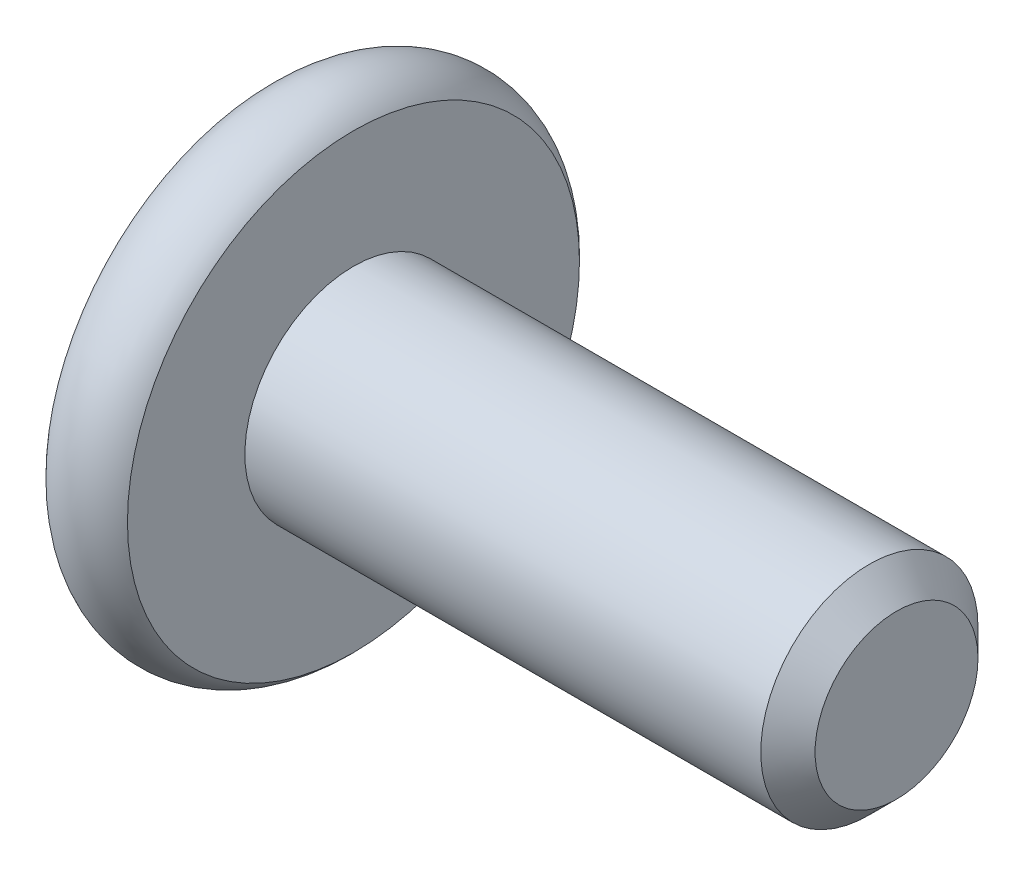
ISO-10303-21;
HEADER;
FILE_DESCRIPTION(('STEP AP214'),'2;1');
FILE_NAME('part.step','',(''),(''),'','','');
FILE_SCHEMA(('AUTOMOTIVE_DESIGN { 1 0 10303 214 1 1 1 1 }'));
ENDSEC;
DATA;
#1=APPLICATION_CONTEXT('core data for automotive mechanical design processes');
#2=APPLICATION_PROTOCOL_DEFINITION('international standard','automotive_design',2000,#1);
#3=PRODUCT_CONTEXT('',#1,'mechanical');
#4=PRODUCT('Part','Part','',(#3));
#5=PRODUCT_RELATED_PRODUCT_CATEGORY('part','',(#4));
#6=PRODUCT_DEFINITION_FORMATION('','',#4);
#7=PRODUCT_DEFINITION_CONTEXT('part definition',#1,'design');
#8=PRODUCT_DEFINITION('design','',#6,#7);
#9=PRODUCT_DEFINITION_SHAPE('','',#8);
#10=(LENGTH_UNIT() NAMED_UNIT(*) SI_UNIT(.MILLI.,.METRE.));
#11=(NAMED_UNIT(*) PLANE_ANGLE_UNIT() SI_UNIT($,.RADIAN.));
#12=(NAMED_UNIT(*) SI_UNIT($,.STERADIAN.) SOLID_ANGLE_UNIT());
#13=UNCERTAINTY_MEASURE_WITH_UNIT(LENGTH_MEASURE(1.E-05),#10,'distance_accuracy_value','');
#14=(GEOMETRIC_REPRESENTATION_CONTEXT(3) GLOBAL_UNCERTAINTY_ASSIGNED_CONTEXT((#13)) GLOBAL_UNIT_ASSIGNED_CONTEXT((#10,
#11,#12)) REPRESENTATION_CONTEXT('',''));
#15=CARTESIAN_POINT('',(0.,0.,0.));
#16=DIRECTION('',(0.,0.,1.));
#17=DIRECTION('',(1.,0.,0.));
#18=AXIS2_PLACEMENT_3D('',#15,#16,#17);
#19=CARTESIAN_POINT('',(-10.,0.,0.));
#20=DIRECTION('',(1.,0.,0.));
#21=DIRECTION('',(0.,0.,-1.));
#22=AXIS2_PLACEMENT_3D('',#19,#20,#21);
#23=CYLINDRICAL_SURFACE('',#22,2.);
#24=CARTESIAN_POINT('',(-0.500000000000004,0.,0.));
#25=DIRECTION('',(1.,0.,0.));
#26=DIRECTION('',(0.,0.,-1.));
#27=AXIS2_PLACEMENT_3D('',#24,#25,#26);
#28=CIRCLE('',#27,2.);
#29=CARTESIAN_POINT('',(-0.500000000000004,0.,-2.));
#30=VERTEX_POINT('',#29);
#31=EDGE_CURVE('E49',#30,#30,#28,.F.);
#32=ORIENTED_EDGE('',*,*,#31,.T.);
#33=EDGE_LOOP('',(#32));
#34=FACE_BOUND('',#33,.T.);
#35=CARTESIAN_POINT('',(-10.,0.,0.));
#36=DIRECTION('',(1.,0.,0.));
#37=DIRECTION('',(0.,1.,0.));
#38=AXIS2_PLACEMENT_3D('',#35,#36,#37);
#39=CIRCLE('',#38,2.);
#40=CARTESIAN_POINT('',(-10.,1.99999999999999,0.));
#41=VERTEX_POINT('',#40);
#42=EDGE_CURVE('E134',#41,#41,#39,.F.);
#43=ORIENTED_EDGE('',*,*,#42,.F.);
#44=EDGE_LOOP('',(#43));
#45=FACE_BOUND('',#44,.T.);
#46=ADVANCED_FACE('F35',(#34,#45),#23,.T.);
#47=CARTESIAN_POINT('',(0.,0.,0.));
#48=DIRECTION('',(1.,0.,0.));
#49=DIRECTION('',(0.,0.,-1.));
#50=AXIS2_PLACEMENT_3D('',#47,#48,#49);
#51=PLANE('',#50);
#52=CARTESIAN_POINT('',(0.,0.,0.));
#53=DIRECTION('',(1.,0.,0.));
#54=DIRECTION('',(0.,0.,-1.));
#55=AXIS2_PLACEMENT_3D('',#52,#53,#54);
#56=CIRCLE('',#55,1.5);
#57=CARTESIAN_POINT('',(0.,0.,-1.5));
#58=VERTEX_POINT('',#57);
#59=EDGE_CURVE('E138',#58,#58,#56,.T.);
#60=ORIENTED_EDGE('',*,*,#59,.T.);
#61=EDGE_LOOP('',(#60));
#62=FACE_BOUND('',#61,.T.);
#63=ADVANCED_FACE('F152',(#62),#51,.T.);
#64=CARTESIAN_POINT('',(0.,0.,0.));
#65=DIRECTION('',(-1.,0.,0.));
#66=DIRECTION('',(0.,0.,1.));
#67=AXIS2_PLACEMENT_3D('',#64,#65,#66);
#68=CONICAL_SURFACE('',#67,1.5,0.785398163397447);
#69=ORIENTED_EDGE('',*,*,#31,.F.);
#70=EDGE_LOOP('',(#69));
#71=FACE_BOUND('',#70,.T.);
#72=ORIENTED_EDGE('',*,*,#59,.F.);
#73=EDGE_LOOP('',(#72));
#74=FACE_BOUND('',#73,.T.);
#75=ADVANCED_FACE('F37',(#71,#74),#68,.T.);
#76=CARTESIAN_POINT('',(-11.5,0.,0.));
#77=DIRECTION('',(-1.,0.,0.));
#78=DIRECTION('',(0.,-1.,0.));
#79=AXIS2_PLACEMENT_3D('',#76,#77,#78);
#80=PLANE('',#79);
#81=CARTESIAN_POINT('',(-11.5,0.,0.));
#82=DIRECTION('',(-1.,0.,0.));
#83=DIRECTION('',(0.,-1.,0.));
#84=AXIS2_PLACEMENT_3D('',#81,#82,#83);
#85=CIRCLE('',#84,1.78205080756887);
#86=CARTESIAN_POINT('',(-11.5,-1.78205080756883,0.));
#87=VERTEX_POINT('',#86);
#88=EDGE_CURVE('E376',#87,#87,#85,.T.);
#89=ORIENTED_EDGE('',*,*,#88,.F.);
#90=EDGE_LOOP('',(#89));
#91=FACE_BOUND('',#90,.T.);
#92=CARTESIAN_POINT('',(-11.5,0.,0.));
#93=DIRECTION('',(1.,0.,0.));
#94=DIRECTION('',(0.,1.,0.));
#95=AXIS2_PLACEMENT_3D('',#92,#93,#94);
#96=CIRCLE('',#95,4.16143782776615);
#97=CARTESIAN_POINT('',(-11.5,4.16143782776615,0.));
#98=VERTEX_POINT('',#97);
#99=EDGE_CURVE('E130',#98,#98,#96,.T.);
#100=ORIENTED_EDGE('',*,*,#99,.F.);
#101=EDGE_LOOP('',(#100));
#102=FACE_BOUND('',#101,.T.);
#103=ADVANCED_FACE('F151',(#91,#102),#80,.T.);
#104=CARTESIAN_POINT('',(-10.75,0.,0.));
#105=DIRECTION('',(1.,0.,0.));
#106=DIRECTION('',(0.,1.,0.));
#107=AXIS2_PLACEMENT_3D('',#104,#105,#106);
#108=TOROIDAL_SURFACE('',#107,3.5,1.);
#109=ORIENTED_EDGE('',*,*,#99,.T.);
#110=EDGE_LOOP('',(#109));
#111=FACE_BOUND('',#110,.T.);
#112=CARTESIAN_POINT('',(-10.,0.,0.));
#113=DIRECTION('',(1.,0.,0.));
#114=DIRECTION('',(0.,1.,0.));
#115=AXIS2_PLACEMENT_3D('',#112,#113,#114);
#116=CIRCLE('',#115,4.16143782776615);
#117=CARTESIAN_POINT('',(-10.,4.16143782776615,0.));
#118=VERTEX_POINT('',#117);
#119=EDGE_CURVE('E126',#118,#118,#116,.T.);
#120=ORIENTED_EDGE('',*,*,#119,.F.);
#121=EDGE_LOOP('',(#120));
#122=FACE_BOUND('',#121,.T.);
#123=ADVANCED_FACE('F163',(#111,#122),#108,.T.);
#124=CARTESIAN_POINT('',(-10.,4.16143782776615,0.));
#125=DIRECTION('',(1.,0.,0.));
#126=DIRECTION('',(0.,1.,0.));
#127=AXIS2_PLACEMENT_3D('',#124,#125,#126);
#128=PLANE('',#127);
#129=ORIENTED_EDGE('',*,*,#42,.T.);
#130=EDGE_LOOP('',(#129));
#131=FACE_BOUND('',#130,.T.);
#132=ORIENTED_EDGE('',*,*,#119,.T.);
#133=EDGE_LOOP('',(#132));
#134=FACE_BOUND('',#133,.T.);
#135=ADVANCED_FACE('F167',(#131,#134),#128,.T.);
#136=CARTESIAN_POINT('',(-11.5,0.,0.));
#137=DIRECTION('',(-1.,0.,0.));
#138=DIRECTION('',(0.,-1.,0.));
#139=AXIS2_PLACEMENT_3D('',#136,#137,#138);
#140=CONICAL_SURFACE('',#139,1.78205080756887,0.78539816339745);
#141=ORIENTED_EDGE('',*,*,#88,.T.);
#142=EDGE_LOOP('',(#141));
#143=FACE_BOUND('',#142,.T.);
#144=CARTESIAN_POINT('',(-12.015428085613,-1.74023253176579,1.5));
#145=CARTESIAN_POINT('',(-11.9833811073445,-1.69791724929732,1.5));
#146=CARTESIAN_POINT('',(-11.9516444672841,-1.65536760966793,1.5));
#147=CARTESIAN_POINT('',(-11.8889203936153,-1.56970398156686,1.5));
#148=CARTESIAN_POINT('',(-11.85793314822,-1.5265898554285,1.5));
#149=CARTESIAN_POINT('',(-11.765846164345,-1.39562626326564,1.5));
#150=CARTESIAN_POINT('',(-11.7061145123021,-1.30679868010577,1.5));
#151=CARTESIAN_POINT('',(-11.5887342891012,-1.12044622640216,1.5));
#152=CARTESIAN_POINT('',(-11.5314082774822,-1.02271587306674,1.5));
#153=CARTESIAN_POINT('',(-11.426463214976,-0.822357214965268,1.5));
#154=CARTESIAN_POINT('',(-11.3788114236896,-0.719746931701931,1.5));
#155=CARTESIAN_POINT('',(-11.320509988315,-0.565852387095104,1.5));
#156=CARTESIAN_POINT('',(-11.3037990535409,-0.516874191424692,1.5));
#157=CARTESIAN_POINT('',(-11.2743077515089,-0.417723988457531,1.5));
#158=CARTESIAN_POINT('',(-11.2615276514219,-0.367551900263897,1.5));
#159=CARTESIAN_POINT('',(-11.2407784202458,-0.267158299056148,1.5));
#160=CARTESIAN_POINT('',(-11.2327260618259,-0.216954261864884,1.5));
#161=CARTESIAN_POINT('',(-11.221591636834,-0.115994915871349,1.5));
#162=CARTESIAN_POINT('',(-11.2185086886377,-0.0652397064615661,1.5));
#163=CARTESIAN_POINT('',(-11.2175473897404,0.0344222234875302,1.5));
#164=CARTESIAN_POINT('',(-11.2194789216952,0.0833271701100644,1.5));
#165=CARTESIAN_POINT('',(-11.2280175729677,0.180724293127197,1.5));
#166=CARTESIAN_POINT('',(-11.234625142048,0.229216429361705,1.5));
#167=CARTESIAN_POINT('',(-11.2522650626447,0.326258027696984,1.5));
#168=CARTESIAN_POINT('',(-11.263373168201,0.374793507450005,1.5));
#169=CARTESIAN_POINT('',(-11.2894198669595,0.470802295834159,1.5));
#170=CARTESIAN_POINT('',(-11.3043581560035,0.518275688481262,1.5));
#171=CARTESIAN_POINT('',(-11.356839545716,0.667150562065111,1.5));
#172=CARTESIAN_POINT('',(-11.4003351165442,0.76644836242683,1.5));
#173=CARTESIAN_POINT('',(-11.4970587814836,0.960384405673816,1.5));
#174=CARTESIAN_POINT('',(-11.5503217226675,1.05500437383619,1.5));
#175=CARTESIAN_POINT('',(-11.6602258010453,1.2358452032153,1.5));
#176=CARTESIAN_POINT('',(-11.7165682531046,1.32224986946548,1.5));
#177=CARTESIAN_POINT('',(-11.803675572597,1.44954953726471,1.5));
#178=CARTESIAN_POINT('',(-11.8330199906839,1.49143368482421,1.5));
#179=CARTESIAN_POINT('',(-11.892486918293,1.57462914783242,1.5));
#180=CARTESIAN_POINT('',(-11.9226092115007,1.61594061772577,1.5));
#181=CARTESIAN_POINT('',(-11.9530541181365,1.65701358742551,1.5));
#182=B_SPLINE_CURVE_WITH_KNOTS('',3,(#144,#145,#146,#147,#148,#149,#150,#151,#152,#153,#154,
#155,#156,#157,#158,#159,#160,#161,#162,#163,#164,#165,#166,#167,#168,#169,#170,#171,#172,#173,
#174,#175,#176,#177,#178,#179,#180,#181),.UNSPECIFIED.,.F.,.F.,(4,2,2,2,2,2,2,2,2,2,2,2,2,2,2,2,
2,2,4),(0.,0.159238974218354,0.318517535014542,0.639504781932389,0.9791378937992,
1.31760168934357,1.47272233841624,1.62785352839776,1.78016486537347,1.93244917778279,
2.07904486260298,2.22565464958333,2.37484213303399,2.5240177730404,2.84828365283776,
3.1737297566675,3.48303030530537,3.63644667013909,3.78982082222913),.UNSPECIFIED.);
#183=CARTESIAN_POINT('',(-11.45,-0.866025403784405,1.5));
#184=VERTEX_POINT('',#183);
#185=CARTESIAN_POINT('',(-11.45,0.866025403784473,1.5));
#186=VERTEX_POINT('',#185);
#187=EDGE_CURVE('E104',#184,#186,#182,.T.);
#188=ORIENTED_EDGE('',*,*,#187,.F.);
#189=CARTESIAN_POINT('',(-11.4501154816001,-1.73216627762268,-0.0002000000000008));
#190=CARTESIAN_POINT('',(-11.4203654760673,-1.70239359975912,0.0513677907370747));
#191=CARTESIAN_POINT('',(-11.3923624839103,-1.67212305186352,0.1037979176652));
#192=CARTESIAN_POINT('',(-11.3410892304402,-1.61039789003616,0.210709034055596));
#193=CARTESIAN_POINT('',(-11.3178475050444,-1.57893740312611,0.26520019581466));
#194=CARTESIAN_POINT('',(-11.2780337289922,-1.51549879897984,0.375079081357248));
#195=CARTESIAN_POINT('',(-11.2613615856709,-1.48353684526807,0.430438809095199));
#196=CARTESIAN_POINT('',(-11.2356744568181,-1.41890915196208,0.54237725747715));
#197=CARTESIAN_POINT('',(-11.2266402904789,-1.38624538781115,0.598952556553008));
#198=CARTESIAN_POINT('',(-11.2184890812269,-1.32995210095296,0.696455389516441));
#199=CARTESIAN_POINT('',(-11.2172822529892,-1.30639533311121,0.737256908280466));
#200=CARTESIAN_POINT('',(-11.2193140571623,-1.2593233529019,0.818787969615858));
#201=CARTESIAN_POINT('',(-11.2225536707483,-1.2358081508531,0.85951749431463));
#202=CARTESIAN_POINT('',(-11.233291985982,-1.18900414978423,0.940584402163416));
#203=CARTESIAN_POINT('',(-11.2407946530187,-1.16571558211716,0.980921384598288));
#204=CARTESIAN_POINT('',(-11.2596516119283,-1.11952932016332,1.06091833691403));
#205=CARTESIAN_POINT('',(-11.2710075570186,-1.09663179808783,1.10057800851621));
#206=CARTESIAN_POINT('',(-11.3047216475927,-1.03798159809695,1.20216313477448));
#207=CARTESIAN_POINT('',(-11.3296218490934,-1.00259267147462,1.26345855370969));
#208=CARTESIAN_POINT('',(-11.3716566532716,-0.950557780604341,1.35358562846331));
#209=CARTESIAN_POINT('',(-11.3864251535591,-0.933410759677114,1.38328513990772));
#210=CARTESIAN_POINT('',(-11.4173105659402,-0.899432101996373,1.44213790138375));
#211=CARTESIAN_POINT('',(-11.4334268341217,-0.882600319285676,1.47129140422064));
#212=CARTESIAN_POINT('',(-11.4501154816001,-0.865909933730567,1.5002));
#213=B_SPLINE_CURVE_WITH_KNOTS('',3,(#189,#190,#191,#192,#193,#194,#195,#196,#197,#198,#199,
#200,#201,#202,#203,#204,#205,#206,#207,#208,#209,#210,#211,#212),.UNSPECIFIED.,.F.,.F.,(4,2,2,
2,2,2,2,2,2,2,2,4),(0.,0.199829143693304,0.400822987382389,0.598623720538181,0.795926240188889,
0.937113067959881,1.07833105577193,1.21968061668222,1.36109089931054,1.58570969637565,
1.69770705470963,1.80965120737193),.UNSPECIFIED.);
#214=CARTESIAN_POINT('',(-11.45,-1.73205080756884,0.));
#215=VERTEX_POINT('',#214);
#216=EDGE_CURVE('E209',#215,#184,#213,.T.);
#217=ORIENTED_EDGE('',*,*,#216,.F.);
#218=CARTESIAN_POINT('',(-11.4501154816001,-0.865909933730566,-1.5002));
#219=CARTESIAN_POINT('',(-11.4203654760673,-0.895682611594131,-1.44863220926292));
#220=CARTESIAN_POINT('',(-11.3923624839103,-0.92595315948973,-1.3962020823348));
#221=CARTESIAN_POINT('',(-11.3410892304402,-0.987678321317089,-1.2892909659444));
#222=CARTESIAN_POINT('',(-11.3178475050444,-1.01913880822714,-1.23479980418534));
#223=CARTESIAN_POINT('',(-11.2780337289922,-1.08257741237341,-1.12492091864275));
#224=CARTESIAN_POINT('',(-11.2613615856709,-1.11453936608518,-1.0695611909048));
#225=CARTESIAN_POINT('',(-11.2356744568181,-1.17916705939117,-0.95762274252285));
#226=CARTESIAN_POINT('',(-11.2266402904789,-1.2118308235421,-0.901047443446992));
#227=CARTESIAN_POINT('',(-11.2184890812269,-1.26812411040029,-0.80354461048356));
#228=CARTESIAN_POINT('',(-11.2172822529892,-1.29168087824204,-0.762743091719535));
#229=CARTESIAN_POINT('',(-11.2193140571623,-1.33875285845135,-0.681212030384143));
#230=CARTESIAN_POINT('',(-11.2225536707483,-1.36226806050015,-0.640482505685371));
#231=CARTESIAN_POINT('',(-11.233291985982,-1.40907206156902,-0.559415597836585));
#232=CARTESIAN_POINT('',(-11.2407946530187,-1.43236062923609,-0.519078615401713));
#233=CARTESIAN_POINT('',(-11.2596516119283,-1.47854689118993,-0.43908166308597));
#234=CARTESIAN_POINT('',(-11.2710075570186,-1.50144441326542,-0.399421991483793));
#235=CARTESIAN_POINT('',(-11.3047216475927,-1.5600946132563,-0.297836865225516));
#236=CARTESIAN_POINT('',(-11.3296218490934,-1.59548353987863,-0.236541446290312));
#237=CARTESIAN_POINT('',(-11.3716566532716,-1.64751843074891,-0.146414371536688));
#238=CARTESIAN_POINT('',(-11.3864251535591,-1.66466545167613,-0.116714860092283));
#239=CARTESIAN_POINT('',(-11.4173105659402,-1.69864410935687,-0.0578620986162504));
#240=CARTESIAN_POINT('',(-11.4334268341217,-1.71547589206757,-0.0287085957793641));
#241=CARTESIAN_POINT('',(-11.4501154816001,-1.73216627762268,0.000199999999998858));
#242=B_SPLINE_CURVE_WITH_KNOTS('',3,(#218,#219,#220,#221,#222,#223,#224,#225,#226,#227,#228,
#229,#230,#231,#232,#233,#234,#235,#236,#237,#238,#239,#240,#241),.UNSPECIFIED.,.F.,.F.,(4,2,2,
2,2,2,2,2,2,2,2,4),(0.,0.199829143693305,0.400822987382389,0.59862372053818,0.795926240188888,
0.937113067959881,1.07833105577193,1.21968061668222,1.36109089931054,1.58570969637565,
1.69770705470963,1.80965120737194),.UNSPECIFIED.);
#243=CARTESIAN_POINT('',(-11.45,-0.866025403784404,-1.5));
#244=VERTEX_POINT('',#243);
#245=EDGE_CURVE('E204',#244,#215,#242,.T.);
#246=ORIENTED_EDGE('',*,*,#245,.F.);
#247=CARTESIAN_POINT('',(-12.0154280857208,-1.74023253190811,-1.5));
#248=CARTESIAN_POINT('',(-11.9833811074482,-1.69791724943564,-1.5));
#249=CARTESIAN_POINT('',(-11.9516444673836,-1.65536760980222,-1.5));
#250=CARTESIAN_POINT('',(-11.8889203937065,-1.56970398169306,-1.5));
#251=CARTESIAN_POINT('',(-11.8579331483071,-1.52658985555063,-1.5));
#252=CARTESIAN_POINT('',(-11.7658461644196,-1.39562626337533,-1.5));
#253=CARTESIAN_POINT('',(-11.7061145123685,-1.306798680207,-1.5));
#254=CARTESIAN_POINT('',(-11.5887342891506,-1.12044622648493,-1.5));
#255=CARTESIAN_POINT('',(-11.5314082775229,-1.02271587313946,-1.5));
#256=CARTESIAN_POINT('',(-11.4264632150005,-0.822357215017057,-1.5));
#257=CARTESIAN_POINT('',(-11.3788114237067,-0.71974693174283,-1.5));
#258=CARTESIAN_POINT('',(-11.3205099883267,-0.565852387127821,-1.5));
#259=CARTESIAN_POINT('',(-11.3037990535528,-0.516874191460856,-1.5));
#260=CARTESIAN_POINT('',(-11.2743077515206,-0.417723988500704,-1.5));
#261=CARTESIAN_POINT('',(-11.2615276514332,-0.367551900310633,-1.5));
#262=CARTESIAN_POINT('',(-11.2407784202553,-0.267158299109893,-1.5));
#263=CARTESIAN_POINT('',(-11.2327260618342,-0.216954261922074,-1.5));
#264=CARTESIAN_POINT('',(-11.2215916368391,-0.115994915935319,-1.5));
#265=CARTESIAN_POINT('',(-11.2185086886407,-0.0652397065288699,-1.5));
#266=CARTESIAN_POINT('',(-11.2175473897388,0.0344222234141573,-1.5));
#267=CARTESIAN_POINT('',(-11.219478921691,0.0833271700339477,-1.5));
#268=CARTESIAN_POINT('',(-11.228017572958,0.180724293045873,-1.5));
#269=CARTESIAN_POINT('',(-11.2346251420354,0.229216429277916,-1.5));
#270=CARTESIAN_POINT('',(-11.2522650626259,0.326258027608331,-1.5));
#271=CARTESIAN_POINT('',(-11.2633731681789,0.374793507358958,-1.5));
#272=CARTESIAN_POINT('',(-11.2894198669309,0.470802295738561,-1.5));
#273=CARTESIAN_POINT('',(-11.3043581559716,0.518275688383506,-1.5));
#274=CARTESIAN_POINT('',(-11.3568395456685,0.667150561946159,-1.5));
#275=CARTESIAN_POINT('',(-11.4003351164823,0.766448362289901,-1.5));
#276=CARTESIAN_POINT('',(-11.4970587813916,0.960384405502316,-1.5));
#277=CARTESIAN_POINT('',(-11.5503217225595,1.0550043736481,-1.5));
#278=CARTESIAN_POINT('',(-11.6602258009069,1.2358452029974,-1.5));
#279=CARTESIAN_POINT('',(-11.7165682529518,1.32224986923424,-1.5));
#280=CARTESIAN_POINT('',(-11.8036755724226,1.44954953701376,-1.5));
#281=CARTESIAN_POINT('',(-11.8330199905024,1.49143368456679,-1.5));
#282=CARTESIAN_POINT('',(-11.8924869180973,1.57462914756209,-1.5));
#283=CARTESIAN_POINT('',(-11.9226092112979,1.615940617449,-1.5));
#284=CARTESIAN_POINT('',(-11.9530541179266,1.65701358714231,-1.5));
#285=B_SPLINE_CURVE_WITH_KNOTS('',3,(#247,#248,#249,#250,#251,#252,#253,#254,#255,#256,#257,
#258,#259,#260,#261,#262,#263,#264,#265,#266,#267,#268,#269,#270,#271,#272,#273,#274,#275,#276,
#277,#278,#279,#280,#281,#282,#283,#284),.UNSPECIFIED.,.F.,.F.,(4,2,2,2,2,2,2,2,2,2,2,2,2,2,2,2,
2,2,4),(0.,0.15923897423548,0.318517535048799,0.639504782001544,0.979137893907515,
1.31760168949067,1.47272233855335,1.6278535285249,1.78016486549105,1.93244917789081,
2.07904486270251,2.22565464967435,2.37484213311585,2.5240177731131,2.8482836528441,
3.17372975660706,3.48303030518781,3.63644666999335,3.78982082205522),.UNSPECIFIED.);
#286=CARTESIAN_POINT('',(-11.45,0.866025403784474,-1.5));
#287=VERTEX_POINT('',#286);
#288=EDGE_CURVE('E56',#287,#244,#285,.F.);
#289=ORIENTED_EDGE('',*,*,#288,.F.);
#290=CARTESIAN_POINT('',(-11.4501154816001,1.73216627762275,0.000200000000000434));
#291=CARTESIAN_POINT('',(-11.4203654760673,1.70239359975919,-0.0513677907370751));
#292=CARTESIAN_POINT('',(-11.3923624839103,1.67212305186359,-0.1037979176652));
#293=CARTESIAN_POINT('',(-11.3410892304401,1.61039789003623,-0.210709034055596));
#294=CARTESIAN_POINT('',(-11.3178475050444,1.57893740312618,-0.265200195814661));
#295=CARTESIAN_POINT('',(-11.2780337289922,1.51549879897991,-0.375079081357249));
#296=CARTESIAN_POINT('',(-11.2613615856709,1.48353684526814,-0.4304388090952));
#297=CARTESIAN_POINT('',(-11.2356744568181,1.41890915196215,-0.542377257477151));
#298=CARTESIAN_POINT('',(-11.2266402904789,1.38624538781122,-0.598952556553009));
#299=CARTESIAN_POINT('',(-11.2184890812269,1.32995210095303,-0.696455389516441));
#300=CARTESIAN_POINT('',(-11.2172822529892,1.30639533311127,-0.737256908280467));
#301=CARTESIAN_POINT('',(-11.2193140571623,1.25932335290197,-0.818787969615859));
#302=CARTESIAN_POINT('',(-11.2225536707483,1.23580815085317,-0.859517494314631));
#303=CARTESIAN_POINT('',(-11.233291985982,1.1890041497843,-0.940584402163417));
#304=CARTESIAN_POINT('',(-11.2407946530187,1.16571558211723,-0.980921384598289));
#305=CARTESIAN_POINT('',(-11.2596516119283,1.11952932016339,-1.06091833691403));
#306=CARTESIAN_POINT('',(-11.2710075570186,1.0966317980879,-1.10057800851621));
#307=CARTESIAN_POINT('',(-11.3047216475927,1.03798159809702,-1.20216313477449));
#308=CARTESIAN_POINT('',(-11.3296218490934,1.00259267147469,-1.26345855370969));
#309=CARTESIAN_POINT('',(-11.3716566532716,0.950557780604409,-1.35358562846331));
#310=CARTESIAN_POINT('',(-11.3864251535591,0.933410759677182,-1.38328513990772));
#311=CARTESIAN_POINT('',(-11.4173105659402,0.899432101996442,-1.44213790138375));
#312=CARTESIAN_POINT('',(-11.4334268341217,0.882600319285745,-1.47129140422064));
#313=CARTESIAN_POINT('',(-11.4501154816001,0.865909933730636,-1.5002));
#314=B_SPLINE_CURVE_WITH_KNOTS('',3,(#290,#291,#292,#293,#294,#295,#296,#297,#298,#299,#300,
#301,#302,#303,#304,#305,#306,#307,#308,#309,#310,#311,#312,#313),.UNSPECIFIED.,.F.,.F.,(4,2,2,
2,2,2,2,2,2,2,2,4),(0.,0.199829143693305,0.400822987382389,0.598623720538182,0.79592624018889,
0.937113067959883,1.07833105577193,1.21968061668222,1.36109089931055,1.58570969637566,
1.69770705470963,1.80965120737194),.UNSPECIFIED.);
#315=CARTESIAN_POINT('',(-11.45,1.73205080756891,0.));
#316=VERTEX_POINT('',#315);
#317=EDGE_CURVE('E11',#316,#287,#314,.T.);
#318=ORIENTED_EDGE('',*,*,#317,.F.);
#319=CARTESIAN_POINT('',(-11.4501154816001,0.865909933730636,1.5002));
#320=CARTESIAN_POINT('',(-11.4203654760673,0.8956826115942,1.44863220926292));
#321=CARTESIAN_POINT('',(-11.3923624839103,0.9259531594898,1.3962020823348));
#322=CARTESIAN_POINT('',(-11.3410892304401,0.987678321317157,1.2892909659444));
#323=CARTESIAN_POINT('',(-11.3178475050444,1.01913880822721,1.23479980418534));
#324=CARTESIAN_POINT('',(-11.2780337289922,1.08257741237348,1.12492091864275));
#325=CARTESIAN_POINT('',(-11.2613615856709,1.11453936608525,1.0695611909048));
#326=CARTESIAN_POINT('',(-11.2356744568181,1.17916705939124,0.95762274252285));
#327=CARTESIAN_POINT('',(-11.2266402904789,1.21183082354217,0.901047443446992));
#328=CARTESIAN_POINT('',(-11.2184890812269,1.26812411040035,0.80354461048356));
#329=CARTESIAN_POINT('',(-11.2172822529892,1.29168087824211,0.762743091719535));
#330=CARTESIAN_POINT('',(-11.2193140571623,1.33875285845141,0.681212030384143));
#331=CARTESIAN_POINT('',(-11.2225536707483,1.36226806050022,0.640482505685371));
#332=CARTESIAN_POINT('',(-11.233291985982,1.40907206156908,0.559415597836585));
#333=CARTESIAN_POINT('',(-11.2407946530187,1.43236062923615,0.519078615401713));
#334=CARTESIAN_POINT('',(-11.2596516119283,1.47854689119,0.43908166308597));
#335=CARTESIAN_POINT('',(-11.2710075570186,1.50144441326549,0.399421991483793));
#336=CARTESIAN_POINT('',(-11.3047216475927,1.56009461325637,0.297836865225516));
#337=CARTESIAN_POINT('',(-11.3296218490934,1.5954835398787,0.236541446290312));
#338=CARTESIAN_POINT('',(-11.3716566532716,1.64751843074898,0.146414371536687));
#339=CARTESIAN_POINT('',(-11.3864251535591,1.6646654516762,0.116714860092283));
#340=CARTESIAN_POINT('',(-11.4173105659402,1.69864410935694,0.0578620986162497));
#341=CARTESIAN_POINT('',(-11.4334268341217,1.71547589206764,0.0287085957793634));
#342=CARTESIAN_POINT('',(-11.4501154816001,1.73216627762275,-0.000199999999999442));
#343=B_SPLINE_CURVE_WITH_KNOTS('',3,(#319,#320,#321,#322,#323,#324,#325,#326,#327,#328,#329,
#330,#331,#332,#333,#334,#335,#336,#337,#338,#339,#340,#341,#342),.UNSPECIFIED.,.F.,.F.,(4,2,2,
2,2,2,2,2,2,2,2,4),(0.,0.199829143693304,0.400822987382387,0.598623720538179,0.795926240188887,
0.937113067959879,1.07833105577193,1.21968061668222,1.36109089931054,1.58570969637565,
1.69770705470963,1.80965120737194),.UNSPECIFIED.);
#344=EDGE_CURVE('E94',#186,#316,#343,.T.);
#345=ORIENTED_EDGE('',*,*,#344,.F.);
#346=EDGE_LOOP('',(#188,#217,#246,#289,#318,#345));
#347=FACE_BOUND('',#346,.T.);
#348=ADVANCED_FACE('F93',(#143,#347),#140,.F.);
#349=CARTESIAN_POINT('',(-9.2,0.,0.));
#350=DIRECTION('',(-1.,0.,0.));
#351=DIRECTION('',(0.,-1.,0.));
#352=AXIS2_PLACEMENT_3D('',#349,#350,#351);
#353=PLANE('',#352);
#354=DIRECTION('',(0.,0.5,-0.866025403784438));
#355=VECTOR('',#354,1.);
#356=CARTESIAN_POINT('',(-9.19999999999999,0.866025403784465,1.5));
#357=LINE('',#356,#355);
#358=CARTESIAN_POINT('',(-9.19999999999999,0.866025403784465,1.5));
#359=VERTEX_POINT('',#358);
#360=CARTESIAN_POINT('',(-9.19999999999999,1.7320508075689,0.));
#361=VERTEX_POINT('',#360);
#362=EDGE_CURVE('E103',#359,#361,#357,.T.);
#363=ORIENTED_EDGE('',*,*,#362,.T.);
#364=DIRECTION('',(0.,-0.5,-0.866025403784439));
#365=VECTOR('',#364,1.);
#366=CARTESIAN_POINT('',(-9.19999999999999,1.7320508075689,0.));
#367=LINE('',#366,#365);
#368=CARTESIAN_POINT('',(-9.19999999999999,0.866025403784465,-1.5));
#369=VERTEX_POINT('',#368);
#370=EDGE_CURVE('E108',#361,#369,#367,.T.);
#371=ORIENTED_EDGE('',*,*,#370,.T.);
#372=DIRECTION('',(0.,-1.,0.));
#373=VECTOR('',#372,1.);
#374=CARTESIAN_POINT('',(-9.19999999999999,0.866025403784465,-1.5));
#375=LINE('',#374,#373);
#376=CARTESIAN_POINT('',(-9.2,-0.866025403784413,-1.5));
#377=VERTEX_POINT('',#376);
#378=EDGE_CURVE('E235',#369,#377,#375,.T.);
#379=ORIENTED_EDGE('',*,*,#378,.T.);
#380=DIRECTION('',(0.,-0.5,0.866025403784439));
#381=VECTOR('',#380,1.);
#382=CARTESIAN_POINT('',(-9.2,-0.866025403784413,-1.5));
#383=LINE('',#382,#381);
#384=CARTESIAN_POINT('',(-9.2,-1.73205080756885,0.));
#385=VERTEX_POINT('',#384);
#386=EDGE_CURVE('E240',#377,#385,#383,.T.);
#387=ORIENTED_EDGE('',*,*,#386,.T.);
#388=DIRECTION('',(0.,0.5,0.866025403784439));
#389=VECTOR('',#388,1.);
#390=CARTESIAN_POINT('',(-9.2,-1.73205080756885,0.));
#391=LINE('',#390,#389);
#392=CARTESIAN_POINT('',(-9.2,-0.866025403784413,1.5));
#393=VERTEX_POINT('',#392);
#394=EDGE_CURVE('E122',#385,#393,#391,.T.);
#395=ORIENTED_EDGE('',*,*,#394,.T.);
#396=DIRECTION('',(0.,1.,0.));
#397=VECTOR('',#396,1.);
#398=CARTESIAN_POINT('',(-9.2,-0.866025403784413,1.5));
#399=LINE('',#398,#397);
#400=EDGE_CURVE('E112',#393,#359,#399,.T.);
#401=ORIENTED_EDGE('',*,*,#400,.T.);
#402=EDGE_LOOP('',(#363,#371,#379,#387,#395,#401));
#403=FACE_BOUND('',#402,.T.);
#404=ADVANCED_FACE('F191',(#403),#353,.T.);
#405=CARTESIAN_POINT('',(-9.19999999999999,1.7320508075689,0.));
#406=DIRECTION('',(0.,0.866025403784439,-0.5));
#407=DIRECTION('',(0.,0.5,0.866025403784439));
#408=AXIS2_PLACEMENT_3D('',#405,#406,#407);
#409=PLANE('',#408);
#410=DIRECTION('',(-1.,0.,0.));
#411=VECTOR('',#410,1.);
#412=CARTESIAN_POINT('',(-9.19999999999999,1.7320508075689,0.));
#413=LINE('',#412,#411);
#414=EDGE_CURVE('E100',#361,#316,#413,.T.);
#415=ORIENTED_EDGE('',*,*,#414,.T.);
#416=ORIENTED_EDGE('',*,*,#317,.T.);
#417=DIRECTION('',(-1.,0.,0.));
#418=VECTOR('',#417,1.);
#419=CARTESIAN_POINT('',(-9.19999999999999,0.866025403784465,-1.5));
#420=LINE('',#419,#418);
#421=EDGE_CURVE('E111',#369,#287,#420,.T.);
#422=ORIENTED_EDGE('',*,*,#421,.F.);
#423=ORIENTED_EDGE('',*,*,#370,.F.);
#424=EDGE_LOOP('',(#415,#416,#422,#423));
#425=FACE_BOUND('',#424,.T.);
#426=ADVANCED_FACE('F106',(#425),#409,.F.);
#427=CARTESIAN_POINT('',(-9.19999999999999,0.866025403784465,-1.5));
#428=DIRECTION('',(0.,0.,-1.));
#429=DIRECTION('',(0.,1.,0.));
#430=AXIS2_PLACEMENT_3D('',#427,#428,#429);
#431=PLANE('',#430);
#432=ORIENTED_EDGE('',*,*,#421,.T.);
#433=ORIENTED_EDGE('',*,*,#288,.T.);
#434=DIRECTION('',(-1.,0.,0.));
#435=VECTOR('',#434,1.);
#436=CARTESIAN_POINT('',(-9.2,-0.866025403784413,-1.5));
#437=LINE('',#436,#435);
#438=EDGE_CURVE('E118',#377,#244,#437,.T.);
#439=ORIENTED_EDGE('',*,*,#438,.F.);
#440=ORIENTED_EDGE('',*,*,#378,.F.);
#441=EDGE_LOOP('',(#432,#433,#439,#440));
#442=FACE_BOUND('',#441,.T.);
#443=ADVANCED_FACE('F224',(#442),#431,.F.);
#444=CARTESIAN_POINT('',(-9.2,-0.866025403784413,-1.5));
#445=DIRECTION('',(0.,-0.866025403784439,-0.5));
#446=DIRECTION('',(0.,0.5,-0.866025403784438));
#447=AXIS2_PLACEMENT_3D('',#444,#445,#446);
#448=PLANE('',#447);
#449=ORIENTED_EDGE('',*,*,#438,.T.);
#450=ORIENTED_EDGE('',*,*,#245,.T.);
#451=DIRECTION('',(-1.,0.,0.));
#452=VECTOR('',#451,1.);
#453=CARTESIAN_POINT('',(-9.2,-1.73205080756885,0.));
#454=LINE('',#453,#452);
#455=EDGE_CURVE('E256',#385,#215,#454,.T.);
#456=ORIENTED_EDGE('',*,*,#455,.F.);
#457=ORIENTED_EDGE('',*,*,#386,.F.);
#458=EDGE_LOOP('',(#449,#450,#456,#457));
#459=FACE_BOUND('',#458,.T.);
#460=ADVANCED_FACE('F219',(#459),#448,.F.);
#461=CARTESIAN_POINT('',(-9.2,-1.73205080756885,0.));
#462=DIRECTION('',(0.,-0.866025403784439,0.5));
#463=DIRECTION('',(0.,-0.5,-0.866025403784439));
#464=AXIS2_PLACEMENT_3D('',#461,#462,#463);
#465=PLANE('',#464);
#466=ORIENTED_EDGE('',*,*,#455,.T.);
#467=ORIENTED_EDGE('',*,*,#216,.T.);
#468=DIRECTION('',(-1.,0.,0.));
#469=VECTOR('',#468,1.);
#470=CARTESIAN_POINT('',(-9.2,-0.866025403784413,1.5));
#471=LINE('',#470,#469);
#472=EDGE_CURVE('E252',#393,#184,#471,.T.);
#473=ORIENTED_EDGE('',*,*,#472,.F.);
#474=ORIENTED_EDGE('',*,*,#394,.F.);
#475=EDGE_LOOP('',(#466,#467,#473,#474));
#476=FACE_BOUND('',#475,.T.);
#477=ADVANCED_FACE('F216',(#476),#465,.F.);
#478=CARTESIAN_POINT('',(-9.2,-0.866025403784413,1.5));
#479=DIRECTION('',(0.,0.,1.));
#480=DIRECTION('',(1.,0.,0.));
#481=AXIS2_PLACEMENT_3D('',#478,#479,#480);
#482=PLANE('',#481);
#483=ORIENTED_EDGE('',*,*,#472,.T.);
#484=ORIENTED_EDGE('',*,*,#187,.T.);
#485=DIRECTION('',(-1.,0.,0.));
#486=VECTOR('',#485,1.);
#487=CARTESIAN_POINT('',(-9.19999999999999,0.866025403784465,1.5));
#488=LINE('',#487,#486);
#489=EDGE_CURVE('E63',#359,#186,#488,.T.);
#490=ORIENTED_EDGE('',*,*,#489,.F.);
#491=ORIENTED_EDGE('',*,*,#400,.F.);
#492=EDGE_LOOP('',(#483,#484,#490,#491));
#493=FACE_BOUND('',#492,.T.);
#494=ADVANCED_FACE('F174',(#493),#482,.F.);
#495=CARTESIAN_POINT('',(-9.19999999999999,0.866025403784465,1.5));
#496=DIRECTION('',(0.,0.866025403784439,0.5));
#497=DIRECTION('',(0.,-0.5,0.866025403784439));
#498=AXIS2_PLACEMENT_3D('',#495,#496,#497);
#499=PLANE('',#498);
#500=ORIENTED_EDGE('',*,*,#489,.T.);
#501=ORIENTED_EDGE('',*,*,#344,.T.);
#502=ORIENTED_EDGE('',*,*,#414,.F.);
#503=ORIENTED_EDGE('',*,*,#362,.F.);
#504=EDGE_LOOP('',(#500,#501,#502,#503));
#505=FACE_BOUND('',#504,.T.);
#506=ADVANCED_FACE('F99',(#505),#499,.F.);
#507=CLOSED_SHELL('',(#46,#63,#75,#103,#123,#135,#348,#404,#426,#443,#460,#477,#494,#506));
#508=MANIFOLD_SOLID_BREP('B2',#507);
#509=ADVANCED_BREP_SHAPE_REPRESENTATION('',(#18,#508),#14);
#510=SHAPE_DEFINITION_REPRESENTATION(#9,#509);
ENDSEC;
END-ISO-10303-21;
